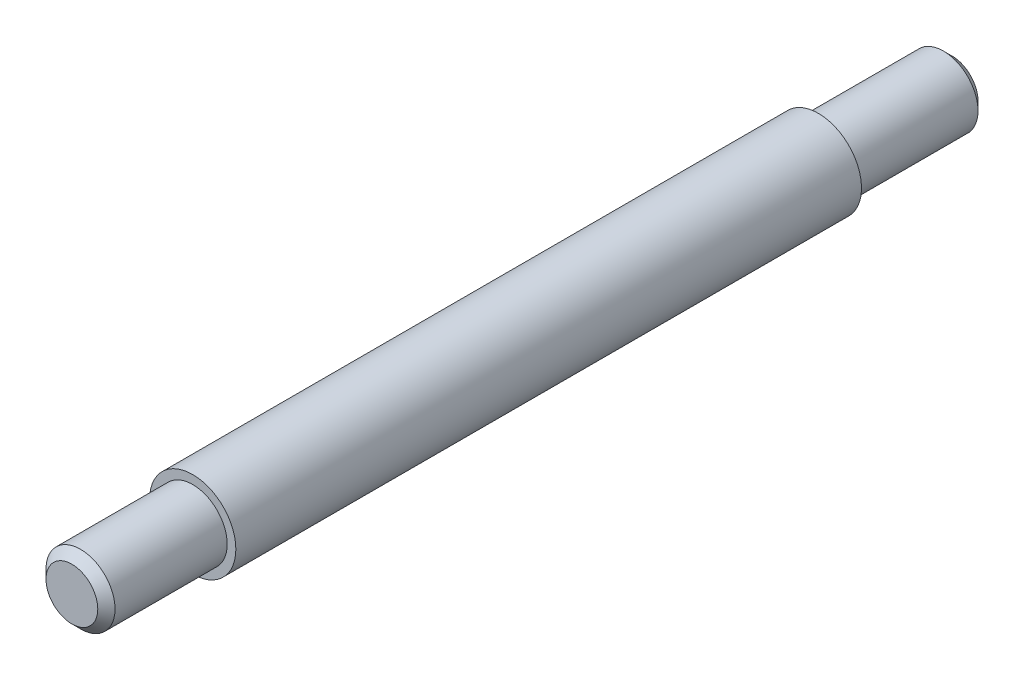
ISO-10303-21;
HEADER;
FILE_DESCRIPTION(('STEP AP214'),'2;1');
FILE_NAME('part.step','',(''),(''),'','','');
FILE_SCHEMA(('AUTOMOTIVE_DESIGN { 1 0 10303 214 1 1 1 1 }'));
ENDSEC;
DATA;
#1=APPLICATION_CONTEXT('core data for automotive mechanical design processes');
#2=APPLICATION_PROTOCOL_DEFINITION('international standard','automotive_design',2000,#1);
#3=PRODUCT_CONTEXT('',#1,'mechanical');
#4=PRODUCT('Part','Part','',(#3));
#5=PRODUCT_RELATED_PRODUCT_CATEGORY('part','',(#4));
#6=PRODUCT_DEFINITION_FORMATION('','',#4);
#7=PRODUCT_DEFINITION_CONTEXT('part definition',#1,'design');
#8=PRODUCT_DEFINITION('design','',#6,#7);
#9=PRODUCT_DEFINITION_SHAPE('','',#8);
#10=(LENGTH_UNIT() NAMED_UNIT(*) SI_UNIT(.MILLI.,.METRE.));
#11=(NAMED_UNIT(*) PLANE_ANGLE_UNIT() SI_UNIT($,.RADIAN.));
#12=(NAMED_UNIT(*) SI_UNIT($,.STERADIAN.) SOLID_ANGLE_UNIT());
#13=UNCERTAINTY_MEASURE_WITH_UNIT(LENGTH_MEASURE(1.E-05),#10,'distance_accuracy_value','');
#14=(GEOMETRIC_REPRESENTATION_CONTEXT(3) GLOBAL_UNCERTAINTY_ASSIGNED_CONTEXT((#13)) GLOBAL_UNIT_ASSIGNED_CONTEXT((#10,
#11,#12)) REPRESENTATION_CONTEXT('',''));
#15=CARTESIAN_POINT('',(0.,0.,0.));
#16=DIRECTION('',(0.,0.,1.));
#17=DIRECTION('',(1.,0.,0.));
#18=AXIS2_PLACEMENT_3D('',#15,#16,#17);
#19=CARTESIAN_POINT('',(0.,0.,204.));
#20=DIRECTION('',(0.,0.,-1.));
#21=DIRECTION('',(-1.,0.,0.));
#22=AXIS2_PLACEMENT_3D('',#19,#20,#21);
#23=CYLINDRICAL_SURFACE('',#22,10.);
#24=CARTESIAN_POINT('',(0.,0.,31.));
#25=DIRECTION('',(0.,0.,-1.));
#26=DIRECTION('',(-1.,0.,0.));
#27=AXIS2_PLACEMENT_3D('',#24,#25,#26);
#28=CIRCLE('',#27,10.);
#29=CARTESIAN_POINT('',(-10.,0.,31.));
#30=VERTEX_POINT('',#29);
#31=EDGE_CURVE('E57',#30,#30,#28,.T.);
#32=ORIENTED_EDGE('',*,*,#31,.F.);
#33=EDGE_LOOP('',(#32));
#34=FACE_BOUND('',#33,.T.);
#35=CARTESIAN_POINT('',(0.,0.,176.));
#36=DIRECTION('',(0.,0.,1.));
#37=DIRECTION('',(1.,0.,0.));
#38=AXIS2_PLACEMENT_3D('',#35,#36,#37);
#39=CIRCLE('',#38,10.);
#40=CARTESIAN_POINT('',(10.,0.,176.));
#41=VERTEX_POINT('',#40);
#42=EDGE_CURVE('E63',#41,#41,#39,.T.);
#43=ORIENTED_EDGE('',*,*,#42,.F.);
#44=EDGE_LOOP('',(#43));
#45=FACE_BOUND('',#44,.T.);
#46=ADVANCED_FACE('F37',(#34,#45),#23,.T.);
#47=CARTESIAN_POINT('',(0.,0.,31.));
#48=DIRECTION('',(0.,0.,-1.));
#49=DIRECTION('',(-1.,0.,0.));
#50=AXIS2_PLACEMENT_3D('',#47,#48,#49);
#51=PLANE('',#50);
#52=CARTESIAN_POINT('',(0.,0.,31.));
#53=DIRECTION('',(0.,0.,-1.));
#54=DIRECTION('',(-1.,0.,0.));
#55=AXIS2_PLACEMENT_3D('',#52,#53,#54);
#56=CIRCLE('',#55,8.);
#57=CARTESIAN_POINT('',(-8.,0.,31.));
#58=VERTEX_POINT('',#57);
#59=EDGE_CURVE('E60',#58,#58,#56,.T.);
#60=ORIENTED_EDGE('',*,*,#59,.F.);
#61=EDGE_LOOP('',(#60));
#62=FACE_BOUND('',#61,.T.);
#63=ORIENTED_EDGE('',*,*,#31,.T.);
#64=EDGE_LOOP('',(#63));
#65=FACE_BOUND('',#64,.T.);
#66=ADVANCED_FACE('F80',(#62,#65),#51,.T.);
#67=CARTESIAN_POINT('',(0.,0.,31.));
#68=DIRECTION('',(0.,0.,-1.));
#69=DIRECTION('',(-1.,0.,0.));
#70=AXIS2_PLACEMENT_3D('',#67,#68,#69);
#71=CYLINDRICAL_SURFACE('',#70,8.);
#72=CARTESIAN_POINT('',(0.,0.,2.00000000000005));
#73=DIRECTION('',(0.,0.,1.));
#74=DIRECTION('',(1.,0.,0.));
#75=AXIS2_PLACEMENT_3D('',#72,#73,#74);
#76=CIRCLE('',#75,8.);
#77=CARTESIAN_POINT('',(8.,0.,2.00000000000005));
#78=VERTEX_POINT('',#77);
#79=EDGE_CURVE('E10',#78,#78,#76,.T.);
#80=ORIENTED_EDGE('',*,*,#79,.T.);
#81=EDGE_LOOP('',(#80));
#82=FACE_BOUND('',#81,.T.);
#83=ORIENTED_EDGE('',*,*,#59,.T.);
#84=EDGE_LOOP('',(#83));
#85=FACE_BOUND('',#84,.T.);
#86=ADVANCED_FACE('F86',(#82,#85),#71,.T.);
#87=CARTESIAN_POINT('',(0.,0.,0.));
#88=DIRECTION('',(0.,0.,1.));
#89=DIRECTION('',(1.,0.,0.));
#90=AXIS2_PLACEMENT_3D('',#87,#88,#89);
#91=PLANE('',#90);
#92=CARTESIAN_POINT('',(0.,0.,0.));
#93=DIRECTION('',(0.,0.,1.));
#94=DIRECTION('',(1.,0.,0.));
#95=AXIS2_PLACEMENT_3D('',#92,#93,#94);
#96=CIRCLE('',#95,5.99999999999995);
#97=CARTESIAN_POINT('',(5.99999999999995,0.,0.));
#98=VERTEX_POINT('',#97);
#99=EDGE_CURVE('E44',#98,#98,#96,.F.);
#100=ORIENTED_EDGE('',*,*,#99,.T.);
#101=EDGE_LOOP('',(#100));
#102=FACE_BOUND('',#101,.T.);
#103=ADVANCED_FACE('F75',(#102),#91,.F.);
#104=CARTESIAN_POINT('',(0.,0.,176.));
#105=DIRECTION('',(0.,0.,1.));
#106=DIRECTION('',(1.,0.,0.));
#107=AXIS2_PLACEMENT_3D('',#104,#105,#106);
#108=PLANE('',#107);
#109=CARTESIAN_POINT('',(0.,0.,176.));
#110=DIRECTION('',(0.,0.,1.));
#111=DIRECTION('',(1.,0.,0.));
#112=AXIS2_PLACEMENT_3D('',#109,#110,#111);
#113=CIRCLE('',#112,8.);
#114=CARTESIAN_POINT('',(8.,0.,176.));
#115=VERTEX_POINT('',#114);
#116=EDGE_CURVE('E66',#115,#115,#113,.T.);
#117=ORIENTED_EDGE('',*,*,#116,.F.);
#118=EDGE_LOOP('',(#117));
#119=FACE_BOUND('',#118,.T.);
#120=ORIENTED_EDGE('',*,*,#42,.T.);
#121=EDGE_LOOP('',(#120));
#122=FACE_BOUND('',#121,.T.);
#123=ADVANCED_FACE('F72',(#119,#122),#108,.T.);
#124=CARTESIAN_POINT('',(0.,0.,176.));
#125=DIRECTION('',(0.,0.,1.));
#126=DIRECTION('',(1.,0.,0.));
#127=AXIS2_PLACEMENT_3D('',#124,#125,#126);
#128=CYLINDRICAL_SURFACE('',#127,8.);
#129=CARTESIAN_POINT('',(0.,0.,202.));
#130=DIRECTION('',(0.,0.,1.));
#131=DIRECTION('',(1.,0.,0.));
#132=AXIS2_PLACEMENT_3D('',#129,#130,#131);
#133=CIRCLE('',#132,8.);
#134=CARTESIAN_POINT('',(8.,0.,202.));
#135=VERTEX_POINT('',#134);
#136=EDGE_CURVE('E48',#135,#135,#133,.F.);
#137=ORIENTED_EDGE('',*,*,#136,.T.);
#138=EDGE_LOOP('',(#137));
#139=FACE_BOUND('',#138,.T.);
#140=ORIENTED_EDGE('',*,*,#116,.T.);
#141=EDGE_LOOP('',(#140));
#142=FACE_BOUND('',#141,.T.);
#143=ADVANCED_FACE('F70',(#139,#142),#128,.T.);
#144=CARTESIAN_POINT('',(0.,0.,204.));
#145=DIRECTION('',(0.,0.,1.));
#146=DIRECTION('',(1.,0.,0.));
#147=AXIS2_PLACEMENT_3D('',#144,#145,#146);
#148=PLANE('',#147);
#149=CARTESIAN_POINT('',(0.,0.,204.));
#150=DIRECTION('',(0.,0.,1.));
#151=DIRECTION('',(1.,0.,0.));
#152=AXIS2_PLACEMENT_3D('',#149,#150,#151);
#153=CIRCLE('',#152,5.99999999999998);
#154=CARTESIAN_POINT('',(5.99999999999998,0.,204.));
#155=VERTEX_POINT('',#154);
#156=EDGE_CURVE('E52',#155,#155,#153,.T.);
#157=ORIENTED_EDGE('',*,*,#156,.T.);
#158=EDGE_LOOP('',(#157));
#159=FACE_BOUND('',#158,.T.);
#160=ADVANCED_FACE('F94',(#159),#148,.T.);
#161=CARTESIAN_POINT('',(0.,0.,204.));
#162=DIRECTION('',(0.,0.,-1.));
#163=DIRECTION('',(-1.,0.,0.));
#164=AXIS2_PLACEMENT_3D('',#161,#162,#163);
#165=CONICAL_SURFACE('',#164,5.99999999999998,0.785398163397447);
#166=ORIENTED_EDGE('',*,*,#136,.F.);
#167=EDGE_LOOP('',(#166));
#168=FACE_BOUND('',#167,.T.);
#169=ORIENTED_EDGE('',*,*,#156,.F.);
#170=EDGE_LOOP('',(#169));
#171=FACE_BOUND('',#170,.T.);
#172=ADVANCED_FACE('F92',(#168,#171),#165,.T.);
#173=CARTESIAN_POINT('',(0.,0.,0.));
#174=DIRECTION('',(0.,0.,1.));
#175=DIRECTION('',(1.,0.,0.));
#176=AXIS2_PLACEMENT_3D('',#173,#174,#175);
#177=CONICAL_SURFACE('',#176,5.99999999999995,0.785398163397448);
#178=ORIENTED_EDGE('',*,*,#79,.F.);
#179=EDGE_LOOP('',(#178));
#180=FACE_BOUND('',#179,.T.);
#181=ORIENTED_EDGE('',*,*,#99,.F.);
#182=EDGE_LOOP('',(#181));
#183=FACE_BOUND('',#182,.T.);
#184=ADVANCED_FACE('F39',(#180,#183),#177,.T.);
#185=CLOSED_SHELL('',(#46,#66,#86,#103,#123,#143,#160,#172,#184));
#186=MANIFOLD_SOLID_BREP('B2',#185);
#187=ADVANCED_BREP_SHAPE_REPRESENTATION('',(#18,#186),#14);
#188=SHAPE_DEFINITION_REPRESENTATION(#9,#187);
ENDSEC;
END-ISO-10303-21;
